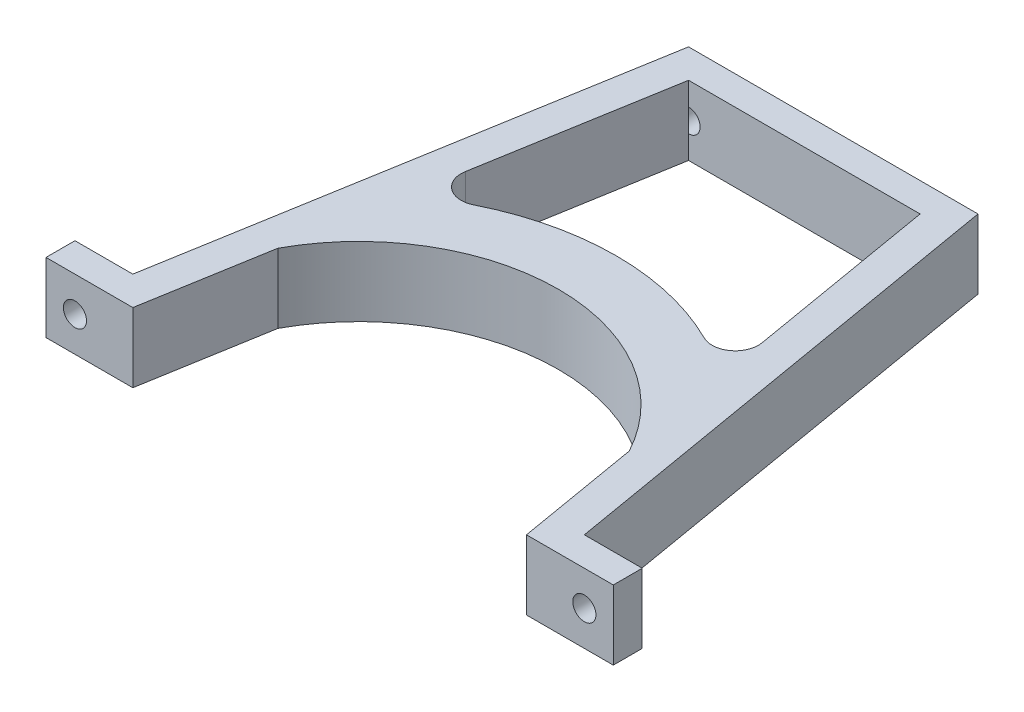
ISO-10303-21;
HEADER;
FILE_DESCRIPTION(('STEP AP214'),'2;1');
FILE_NAME('part.step','',(''),(''),'','','');
FILE_SCHEMA(('AUTOMOTIVE_DESIGN { 1 0 10303 214 1 1 1 1 }'));
ENDSEC;
DATA;
#1=APPLICATION_CONTEXT('core data for automotive mechanical design processes');
#2=APPLICATION_PROTOCOL_DEFINITION('international standard','automotive_design',2000,#1);
#3=PRODUCT_CONTEXT('',#1,'mechanical');
#4=PRODUCT('Part','Part','',(#3));
#5=PRODUCT_RELATED_PRODUCT_CATEGORY('part','',(#4));
#6=PRODUCT_DEFINITION_FORMATION('','',#4);
#7=PRODUCT_DEFINITION_CONTEXT('part definition',#1,'design');
#8=PRODUCT_DEFINITION('design','',#6,#7);
#9=PRODUCT_DEFINITION_SHAPE('','',#8);
#10=(LENGTH_UNIT() NAMED_UNIT(*) SI_UNIT(.MILLI.,.METRE.));
#11=(NAMED_UNIT(*) PLANE_ANGLE_UNIT() SI_UNIT($,.RADIAN.));
#12=(NAMED_UNIT(*) SI_UNIT($,.STERADIAN.) SOLID_ANGLE_UNIT());
#13=UNCERTAINTY_MEASURE_WITH_UNIT(LENGTH_MEASURE(1.E-05),#10,'distance_accuracy_value','');
#14=(GEOMETRIC_REPRESENTATION_CONTEXT(3) GLOBAL_UNCERTAINTY_ASSIGNED_CONTEXT((#13)) GLOBAL_UNIT_ASSIGNED_CONTEXT((#10,
#11,#12)) REPRESENTATION_CONTEXT('',''));
#15=CARTESIAN_POINT('',(0.,0.,0.));
#16=DIRECTION('',(0.,0.,1.));
#17=DIRECTION('',(1.,0.,0.));
#18=AXIS2_PLACEMENT_3D('',#15,#16,#17);
#19=CARTESIAN_POINT('',(0.,12.,-77.));
#20=DIRECTION('',(0.,0.,-1.));
#21=DIRECTION('',(-1.,0.,0.));
#22=AXIS2_PLACEMENT_3D('',#19,#20,#21);
#23=PLANE('',#22);
#24=DIRECTION('',(0.,-1.,0.));
#25=VECTOR('',#24,1.);
#26=CARTESIAN_POINT('',(-20.,12.,-77.));
#27=LINE('',#26,#25);
#28=CARTESIAN_POINT('',(-20.,12.,-77.));
#29=VERTEX_POINT('',#28);
#30=CARTESIAN_POINT('',(-20.,8.,-77.));
#31=VERTEX_POINT('',#30);
#32=EDGE_CURVE('E207',#29,#31,#27,.T.);
#33=ORIENTED_EDGE('',*,*,#32,.T.);
#34=CARTESIAN_POINT('',(-20.,6.,-77.));
#35=DIRECTION('',(0.,0.,1.));
#36=DIRECTION('',(1.,0.,0.));
#37=AXIS2_PLACEMENT_3D('',#34,#35,#36);
#38=CIRCLE('',#37,2.);
#39=CARTESIAN_POINT('',(-20.,4.,-77.));
#40=VERTEX_POINT('',#39);
#41=EDGE_CURVE('E199',#40,#31,#38,.T.);
#42=ORIENTED_EDGE('',*,*,#41,.F.);
#43=CARTESIAN_POINT('',(-20.,0.,-77.));
#44=VERTEX_POINT('',#43);
#45=EDGE_CURVE('E204',#40,#44,#27,.T.);
#46=ORIENTED_EDGE('',*,*,#45,.T.);
#47=DIRECTION('',(1.,0.,0.));
#48=VECTOR('',#47,1.);
#49=CARTESIAN_POINT('',(0.,0.,-77.));
#50=LINE('',#49,#48);
#51=CARTESIAN_POINT('',(20.,0.,-77.));
#52=VERTEX_POINT('',#51);
#53=EDGE_CURVE('E222',#44,#52,#50,.T.);
#54=ORIENTED_EDGE('',*,*,#53,.T.);
#55=DIRECTION('',(0.,-1.,0.));
#56=VECTOR('',#55,1.);
#57=CARTESIAN_POINT('',(20.,12.,-77.));
#58=LINE('',#57,#56);
#59=CARTESIAN_POINT('',(20.,4.,-77.));
#60=VERTEX_POINT('',#59);
#61=EDGE_CURVE('E189',#60,#52,#58,.T.);
#62=ORIENTED_EDGE('',*,*,#61,.F.);
#63=CARTESIAN_POINT('',(20.,6.,-77.));
#64=DIRECTION('',(0.,0.,1.));
#65=DIRECTION('',(1.,0.,0.));
#66=AXIS2_PLACEMENT_3D('',#63,#64,#65);
#67=CIRCLE('',#66,2.);
#68=CARTESIAN_POINT('',(20.,8.,-77.));
#69=VERTEX_POINT('',#68);
#70=EDGE_CURVE('E66',#60,#69,#67,.F.);
#71=ORIENTED_EDGE('',*,*,#70,.T.);
#72=CARTESIAN_POINT('',(20.,12.,-77.));
#73=VERTEX_POINT('',#72);
#74=EDGE_CURVE('E188',#73,#69,#58,.T.);
#75=ORIENTED_EDGE('',*,*,#74,.F.);
#76=DIRECTION('',(1.,0.,0.));
#77=VECTOR('',#76,1.);
#78=CARTESIAN_POINT('',(0.,12.,-77.));
#79=LINE('',#78,#77);
#80=EDGE_CURVE('E268',#29,#73,#79,.T.);
#81=ORIENTED_EDGE('',*,*,#80,.F.);
#82=EDGE_LOOP('',(#33,#42,#46,#54,#62,#71,#75,#81));
#83=FACE_BOUND('',#82,.T.);
#84=ADVANCED_FACE('F43',(#83),#23,.F.);
#85=CARTESIAN_POINT('',(0.,12.,-82.));
#86=DIRECTION('',(0.,0.,-1.));
#87=DIRECTION('',(-1.,0.,0.));
#88=AXIS2_PLACEMENT_3D('',#85,#86,#87);
#89=PLANE('',#88);
#90=CARTESIAN_POINT('',(20.,6.,-82.));
#91=DIRECTION('',(0.,0.,-1.));
#92=DIRECTION('',(-1.,0.,0.));
#93=AXIS2_PLACEMENT_3D('',#90,#91,#92);
#94=CIRCLE('',#93,2.);
#95=CARTESIAN_POINT('',(18.,6.,-82.));
#96=VERTEX_POINT('',#95);
#97=EDGE_CURVE('E314',#96,#96,#94,.F.);
#98=ORIENTED_EDGE('',*,*,#97,.T.);
#99=EDGE_LOOP('',(#98));
#100=FACE_BOUND('',#99,.T.);
#101=DIRECTION('',(1.,0.,0.));
#102=VECTOR('',#101,1.);
#103=CARTESIAN_POINT('',(0.,0.,-82.));
#104=LINE('',#103,#102);
#105=CARTESIAN_POINT('',(-25.,0.,-82.));
#106=VERTEX_POINT('',#105);
#107=CARTESIAN_POINT('',(25.,0.,-82.));
#108=VERTEX_POINT('',#107);
#109=EDGE_CURVE('E240',#106,#108,#104,.T.);
#110=ORIENTED_EDGE('',*,*,#109,.F.);
#111=DIRECTION('',(0.,-1.,0.));
#112=VECTOR('',#111,1.);
#113=CARTESIAN_POINT('',(-25.,12.,-82.));
#114=LINE('',#113,#112);
#115=CARTESIAN_POINT('',(-25.,12.,-82.));
#116=VERTEX_POINT('',#115);
#117=EDGE_CURVE('E339',#116,#106,#114,.T.);
#118=ORIENTED_EDGE('',*,*,#117,.F.);
#119=DIRECTION('',(1.,0.,0.));
#120=VECTOR('',#119,1.);
#121=CARTESIAN_POINT('',(0.,12.,-82.));
#122=LINE('',#121,#120);
#123=CARTESIAN_POINT('',(25.,12.,-82.));
#124=VERTEX_POINT('',#123);
#125=EDGE_CURVE('E284',#116,#124,#122,.T.);
#126=ORIENTED_EDGE('',*,*,#125,.T.);
#127=DIRECTION('',(0.,-1.,0.));
#128=VECTOR('',#127,1.);
#129=CARTESIAN_POINT('',(25.,12.,-82.));
#130=LINE('',#129,#128);
#131=EDGE_CURVE('E341',#124,#108,#130,.T.);
#132=ORIENTED_EDGE('',*,*,#131,.T.);
#133=EDGE_LOOP('',(#110,#118,#126,#132));
#134=FACE_BOUND('',#133,.T.);
#135=CARTESIAN_POINT('',(-20.,6.,-82.));
#136=DIRECTION('',(0.,0.,-1.));
#137=DIRECTION('',(-1.,0.,0.));
#138=AXIS2_PLACEMENT_3D('',#135,#136,#137);
#139=CIRCLE('',#138,2.);
#140=CARTESIAN_POINT('',(-22.,6.,-82.));
#141=VERTEX_POINT('',#140);
#142=EDGE_CURVE('E47',#141,#141,#139,.T.);
#143=ORIENTED_EDGE('',*,*,#142,.F.);
#144=EDGE_LOOP('',(#143));
#145=FACE_BOUND('',#144,.T.);
#146=ADVANCED_FACE('F405',(#100,#134,#145),#89,.T.);
#147=CARTESIAN_POINT('',(0.,12.,0.));
#148=DIRECTION('',(0.,-1.,0.));
#149=DIRECTION('',(0.,0.,-1.));
#150=AXIS2_PLACEMENT_3D('',#147,#148,#149);
#151=CYLINDRICAL_SURFACE('',#150,44.5);
#152=CARTESIAN_POINT('',(0.,0.,0.));
#153=DIRECTION('',(0.,1.,0.));
#154=DIRECTION('',(0.,0.,1.));
#155=AXIS2_PLACEMENT_3D('',#152,#153,#154);
#156=CIRCLE('',#155,44.5);
#157=CARTESIAN_POINT('',(19.8932896206944,0.,-39.8058667543765));
#158=VERTEX_POINT('',#157);
#159=CARTESIAN_POINT('',(-19.8932896206944,0.,-39.8058667543765));
#160=VERTEX_POINT('',#159);
#161=EDGE_CURVE('E228',#158,#160,#156,.T.);
#162=ORIENTED_EDGE('',*,*,#161,.T.);
#163=DIRECTION('',(0.,-1.,0.));
#164=VECTOR('',#163,1.);
#165=CARTESIAN_POINT('',(-19.8932896206944,12.,-39.8058667543765));
#166=LINE('',#165,#164);
#167=CARTESIAN_POINT('',(-19.8932896206944,12.,-39.8058667543765));
#168=VERTEX_POINT('',#167);
#169=EDGE_CURVE('E11',#168,#160,#166,.T.);
#170=ORIENTED_EDGE('',*,*,#169,.F.);
#171=CARTESIAN_POINT('',(0.,12.,0.));
#172=DIRECTION('',(0.,1.,0.));
#173=DIRECTION('',(0.,0.,1.));
#174=AXIS2_PLACEMENT_3D('',#171,#172,#173);
#175=CIRCLE('',#174,44.5);
#176=CARTESIAN_POINT('',(19.8932896206944,12.,-39.8058667543765));
#177=VERTEX_POINT('',#176);
#178=EDGE_CURVE('E273',#177,#168,#175,.T.);
#179=ORIENTED_EDGE('',*,*,#178,.F.);
#180=DIRECTION('',(0.,-1.,0.));
#181=VECTOR('',#180,1.);
#182=CARTESIAN_POINT('',(19.8932896206944,12.,-39.8058667543765));
#183=LINE('',#182,#181);
#184=EDGE_CURVE('E210',#177,#158,#183,.T.);
#185=ORIENTED_EDGE('',*,*,#184,.T.);
#186=EDGE_LOOP('',(#162,#170,#179,#185));
#187=FACE_BOUND('',#186,.T.);
#188=ADVANCED_FACE('F436',(#187),#151,.T.);
#189=CARTESIAN_POINT('',(-21.6814504854759,12.,-43.3839221929721));
#190=DIRECTION('',(0.,-1.,0.));
#191=DIRECTION('',(0.,0.,-1.));
#192=AXIS2_PLACEMENT_3D('',#189,#190,#191);
#193=CYLINDRICAL_SURFACE('',#192,4.);
#194=CARTESIAN_POINT('',(-21.6814504854759,0.,-43.3839221929721));
#195=DIRECTION('',(0.,1.,0.));
#196=DIRECTION('',(0.,0.,1.));
#197=AXIS2_PLACEMENT_3D('',#194,#195,#196);
#198=CIRCLE('',#197,4.);
#199=CARTESIAN_POINT('',(-25.6243961875175,0.,-44.0571080445402));
#200=VERTEX_POINT('',#199);
#201=EDGE_CURVE('E225',#160,#200,#198,.F.);
#202=ORIENTED_EDGE('',*,*,#201,.T.);
#203=DIRECTION('',(0.,-1.,0.));
#204=VECTOR('',#203,1.);
#205=CARTESIAN_POINT('',(-25.6243961875175,12.,-44.0571080445402));
#206=LINE('',#205,#204);
#207=CARTESIAN_POINT('',(-25.6243961875175,12.,-44.0571080445402));
#208=VERTEX_POINT('',#207);
#209=EDGE_CURVE('E52',#208,#200,#206,.T.);
#210=ORIENTED_EDGE('',*,*,#209,.F.);
#211=CARTESIAN_POINT('',(-21.6814504854759,12.,-43.3839221929721));
#212=DIRECTION('',(0.,1.,0.));
#213=DIRECTION('',(0.,0.,1.));
#214=AXIS2_PLACEMENT_3D('',#211,#212,#213);
#215=CIRCLE('',#214,4.);
#216=EDGE_CURVE('E271',#168,#208,#215,.F.);
#217=ORIENTED_EDGE('',*,*,#216,.F.);
#218=ORIENTED_EDGE('',*,*,#169,.T.);
#219=EDGE_LOOP('',(#202,#210,#217,#218));
#220=FACE_BOUND('',#219,.T.);
#221=ADVANCED_FACE('F443',(#220),#193,.F.);
#222=CARTESIAN_POINT('',(-32.2075144508671,12.,-5.49884393063584));
#223=DIRECTION('',(0.985736425510407,0.,0.168296462892021));
#224=DIRECTION('',(0.168296462892021,0.,-0.985736425510407));
#225=AXIS2_PLACEMENT_3D('',#222,#223,#224);
#226=PLANE('',#225);
#227=DIRECTION('',(-0.168296462892021,0.,0.985736425510407));
#228=VECTOR('',#227,1.);
#229=CARTESIAN_POINT('',(-32.2075144508671,0.,-5.49884393063584));
#230=LINE('',#229,#228);
#231=EDGE_CURVE('E224',#44,#200,#230,.T.);
#232=ORIENTED_EDGE('',*,*,#231,.F.);
#233=ORIENTED_EDGE('',*,*,#45,.F.);
#234=EDGE_CURVE('E205',#31,#40,#27,.T.);
#235=ORIENTED_EDGE('',*,*,#234,.F.);
#236=ORIENTED_EDGE('',*,*,#32,.F.);
#237=DIRECTION('',(-0.168296462892021,0.,0.985736425510407));
#238=VECTOR('',#237,1.);
#239=CARTESIAN_POINT('',(-32.2075144508671,12.,-5.49884393063584));
#240=LINE('',#239,#238);
#241=EDGE_CURVE('E270',#29,#208,#240,.T.);
#242=ORIENTED_EDGE('',*,*,#241,.T.);
#243=ORIENTED_EDGE('',*,*,#209,.T.);
#244=EDGE_LOOP('',(#232,#233,#235,#236,#242,#243));
#245=FACE_BOUND('',#244,.T.);
#246=ADVANCED_FACE('F324',(#245),#226,.T.);
#247=CARTESIAN_POINT('',(32.2075144508671,12.,-5.49884393063584));
#248=DIRECTION('',(0.985736425510407,0.,-0.168296462892021));
#249=DIRECTION('',(-0.168296462892021,0.,-0.985736425510407));
#250=AXIS2_PLACEMENT_3D('',#247,#248,#249);
#251=PLANE('',#250);
#252=DIRECTION('',(0.168296462892021,0.,0.985736425510407));
#253=VECTOR('',#252,1.);
#254=CARTESIAN_POINT('',(32.2075144508671,0.,-5.49884393063584));
#255=LINE('',#254,#253);
#256=CARTESIAN_POINT('',(25.6243961875175,0.,-44.0571080445402));
#257=VERTEX_POINT('',#256);
#258=EDGE_CURVE('E221',#52,#257,#255,.T.);
#259=ORIENTED_EDGE('',*,*,#258,.T.);
#260=DIRECTION('',(0.,-1.,0.));
#261=VECTOR('',#260,1.);
#262=CARTESIAN_POINT('',(25.6243961875175,12.,-44.0571080445402));
#263=LINE('',#262,#261);
#264=CARTESIAN_POINT('',(25.6243961875175,12.,-44.0571080445402));
#265=VERTEX_POINT('',#264);
#266=EDGE_CURVE('E209',#265,#257,#263,.T.);
#267=ORIENTED_EDGE('',*,*,#266,.F.);
#268=DIRECTION('',(0.168296462892021,0.,0.985736425510407));
#269=VECTOR('',#268,1.);
#270=CARTESIAN_POINT('',(32.2075144508671,12.,-5.49884393063584));
#271=LINE('',#270,#269);
#272=EDGE_CURVE('E203',#73,#265,#271,.T.);
#273=ORIENTED_EDGE('',*,*,#272,.F.);
#274=ORIENTED_EDGE('',*,*,#74,.T.);
#275=EDGE_CURVE('E182',#69,#60,#58,.T.);
#276=ORIENTED_EDGE('',*,*,#275,.T.);
#277=ORIENTED_EDGE('',*,*,#61,.T.);
#278=EDGE_LOOP('',(#259,#267,#273,#274,#276,#277));
#279=FACE_BOUND('',#278,.T.);
#280=ADVANCED_FACE('F201',(#279),#251,.F.);
#281=CARTESIAN_POINT('',(-30.3433796211126,0.,-16.4173479334833));
#282=VERTEX_POINT('',#281);
#283=CARTESIAN_POINT('',(-34.,0.,5.));
#284=VERTEX_POINT('',#283);
#285=EDGE_CURVE('E261',#282,#284,#230,.T.);
#286=ORIENTED_EDGE('',*,*,#285,.F.);
#287=DIRECTION('',(0.,-1.,0.));
#288=VECTOR('',#287,1.);
#289=CARTESIAN_POINT('',(-30.3433796211126,12.,-16.4173479334833));
#290=LINE('',#289,#288);
#291=CARTESIAN_POINT('',(-30.3433796211126,12.,-16.4173479334833));
#292=VERTEX_POINT('',#291);
#293=EDGE_CURVE('E214',#292,#282,#290,.T.);
#294=ORIENTED_EDGE('',*,*,#293,.F.);
#295=CARTESIAN_POINT('',(-34.,12.,5.));
#296=VERTEX_POINT('',#295);
#297=EDGE_CURVE('E220',#292,#296,#240,.T.);
#298=ORIENTED_EDGE('',*,*,#297,.T.);
#299=DIRECTION('',(0.,-1.,0.));
#300=VECTOR('',#299,1.);
#301=CARTESIAN_POINT('',(-34.,12.,5.));
#302=LINE('',#301,#300);
#303=EDGE_CURVE('E267',#296,#284,#302,.T.);
#304=ORIENTED_EDGE('',*,*,#303,.T.);
#305=EDGE_LOOP('',(#286,#294,#298,#304));
#306=FACE_BOUND('',#305,.T.);
#307=ADVANCED_FACE('F377',(#306),#226,.T.);
#308=CARTESIAN_POINT('',(0.,12.,0.));
#309=DIRECTION('',(0.,-1.,0.));
#310=DIRECTION('',(0.,0.,-1.));
#311=AXIS2_PLACEMENT_3D('',#308,#309,#310);
#312=CYLINDRICAL_SURFACE('',#311,34.5);
#313=CARTESIAN_POINT('',(0.,0.,0.));
#314=DIRECTION('',(0.,1.,0.));
#315=DIRECTION('',(0.,0.,1.));
#316=AXIS2_PLACEMENT_3D('',#313,#314,#315);
#317=CIRCLE('',#316,34.5);
#318=CARTESIAN_POINT('',(30.3433796211126,0.,-16.4173479334833));
#319=VERTEX_POINT('',#318);
#320=EDGE_CURVE('E258',#319,#282,#317,.T.);
#321=ORIENTED_EDGE('',*,*,#320,.F.);
#322=DIRECTION('',(0.,-1.,0.));
#323=VECTOR('',#322,1.);
#324=CARTESIAN_POINT('',(30.3433796211126,12.,-16.4173479334833));
#325=LINE('',#324,#323);
#326=CARTESIAN_POINT('',(30.3433796211126,12.,-16.4173479334833));
#327=VERTEX_POINT('',#326);
#328=EDGE_CURVE('E351',#327,#319,#325,.T.);
#329=ORIENTED_EDGE('',*,*,#328,.F.);
#330=CARTESIAN_POINT('',(0.,12.,0.));
#331=DIRECTION('',(0.,1.,0.));
#332=DIRECTION('',(0.,0.,1.));
#333=AXIS2_PLACEMENT_3D('',#330,#331,#332);
#334=CIRCLE('',#333,34.5);
#335=EDGE_CURVE('E300',#327,#292,#334,.T.);
#336=ORIENTED_EDGE('',*,*,#335,.T.);
#337=ORIENTED_EDGE('',*,*,#293,.T.);
#338=EDGE_LOOP('',(#321,#329,#336,#337));
#339=FACE_BOUND('',#338,.T.);
#340=ADVANCED_FACE('F45',(#339),#312,.F.);
#341=CARTESIAN_POINT('',(34.,0.,5.));
#342=VERTEX_POINT('',#341);
#343=EDGE_CURVE('E255',#319,#342,#255,.T.);
#344=ORIENTED_EDGE('',*,*,#343,.T.);
#345=DIRECTION('',(0.,-1.,0.));
#346=VECTOR('',#345,1.);
#347=CARTESIAN_POINT('',(34.,12.,5.));
#348=LINE('',#347,#346);
#349=CARTESIAN_POINT('',(34.,12.,5.));
#350=VERTEX_POINT('',#349);
#351=EDGE_CURVE('E349',#350,#342,#348,.T.);
#352=ORIENTED_EDGE('',*,*,#351,.F.);
#353=EDGE_CURVE('E298',#327,#350,#271,.T.);
#354=ORIENTED_EDGE('',*,*,#353,.F.);
#355=ORIENTED_EDGE('',*,*,#328,.T.);
#356=EDGE_LOOP('',(#344,#352,#354,#355));
#357=FACE_BOUND('',#356,.T.);
#358=ADVANCED_FACE('F387',(#357),#251,.F.);
#359=CARTESIAN_POINT('',(0.,12.,5.));
#360=DIRECTION('',(0.,0.,1.));
#361=DIRECTION('',(1.,0.,0.));
#362=AXIS2_PLACEMENT_3D('',#359,#360,#361);
#363=PLANE('',#362);
#364=CARTESIAN_POINT('',(44.,6.,5.));
#365=DIRECTION('',(0.,0.,1.));
#366=DIRECTION('',(1.,0.,0.));
#367=AXIS2_PLACEMENT_3D('',#364,#365,#366);
#368=CIRCLE('',#367,2.);
#369=CARTESIAN_POINT('',(46.,6.,5.));
#370=VERTEX_POINT('',#369);
#371=EDGE_CURVE('E264',#370,#370,#368,.T.);
#372=ORIENTED_EDGE('',*,*,#371,.F.);
#373=EDGE_LOOP('',(#372));
#374=FACE_BOUND('',#373,.T.);
#375=DIRECTION('',(-1.,0.,0.));
#376=VECTOR('',#375,1.);
#377=CARTESIAN_POINT('',(0.,0.,5.));
#378=LINE('',#377,#376);
#379=CARTESIAN_POINT('',(49.,0.,5.));
#380=VERTEX_POINT('',#379);
#381=EDGE_CURVE('E252',#380,#342,#378,.T.);
#382=ORIENTED_EDGE('',*,*,#381,.F.);
#383=DIRECTION('',(0.,-1.,0.));
#384=VECTOR('',#383,1.);
#385=CARTESIAN_POINT('',(49.,12.,5.));
#386=LINE('',#385,#384);
#387=CARTESIAN_POINT('',(49.,12.,5.));
#388=VERTEX_POINT('',#387);
#389=EDGE_CURVE('E347',#388,#380,#386,.T.);
#390=ORIENTED_EDGE('',*,*,#389,.F.);
#391=DIRECTION('',(-1.,0.,0.));
#392=VECTOR('',#391,1.);
#393=CARTESIAN_POINT('',(0.,12.,5.));
#394=LINE('',#393,#392);
#395=EDGE_CURVE('E295',#388,#350,#394,.T.);
#396=ORIENTED_EDGE('',*,*,#395,.T.);
#397=ORIENTED_EDGE('',*,*,#351,.T.);
#398=EDGE_LOOP('',(#382,#390,#396,#397));
#399=FACE_BOUND('',#398,.T.);
#400=ADVANCED_FACE('F543',(#374,#399),#363,.T.);
#401=CARTESIAN_POINT('',(49.,12.,0.));
#402=DIRECTION('',(1.,0.,0.));
#403=DIRECTION('',(0.,0.,-1.));
#404=AXIS2_PLACEMENT_3D('',#401,#402,#403);
#405=PLANE('',#404);
#406=DIRECTION('',(0.,0.,1.));
#407=VECTOR('',#406,1.);
#408=CARTESIAN_POINT('',(49.,0.,0.));
#409=LINE('',#408,#407);
#410=CARTESIAN_POINT('',(49.,0.,0.));
#411=VERTEX_POINT('',#410);
#412=EDGE_CURVE('E249',#411,#380,#409,.T.);
#413=ORIENTED_EDGE('',*,*,#412,.F.);
#414=DIRECTION('',(0.,-1.,0.));
#415=VECTOR('',#414,1.);
#416=CARTESIAN_POINT('',(49.,12.,0.));
#417=LINE('',#416,#415);
#418=CARTESIAN_POINT('',(49.,12.,0.));
#419=VERTEX_POINT('',#418);
#420=EDGE_CURVE('E345',#419,#411,#417,.T.);
#421=ORIENTED_EDGE('',*,*,#420,.F.);
#422=DIRECTION('',(0.,0.,1.));
#423=VECTOR('',#422,1.);
#424=CARTESIAN_POINT('',(49.,12.,0.));
#425=LINE('',#424,#423);
#426=EDGE_CURVE('E292',#419,#388,#425,.T.);
#427=ORIENTED_EDGE('',*,*,#426,.T.);
#428=ORIENTED_EDGE('',*,*,#389,.T.);
#429=EDGE_LOOP('',(#413,#421,#427,#428));
#430=FACE_BOUND('',#429,.T.);
#431=ADVANCED_FACE('F393',(#430),#405,.T.);
#432=CARTESIAN_POINT('',(0.,12.,0.));
#433=DIRECTION('',(0.,0.,1.));
#434=DIRECTION('',(1.,0.,0.));
#435=AXIS2_PLACEMENT_3D('',#432,#433,#434);
#436=PLANE('',#435);
#437=CARTESIAN_POINT('',(44.,6.,0.));
#438=DIRECTION('',(0.,0.,1.));
#439=DIRECTION('',(1.,0.,0.));
#440=AXIS2_PLACEMENT_3D('',#437,#438,#439);
#441=CIRCLE('',#440,2.);
#442=CARTESIAN_POINT('',(46.,6.,0.));
#443=VERTEX_POINT('',#442);
#444=EDGE_CURVE('E311',#443,#443,#441,.F.);
#445=ORIENTED_EDGE('',*,*,#444,.F.);
#446=EDGE_LOOP('',(#445));
#447=FACE_BOUND('',#446,.T.);
#448=DIRECTION('',(-1.,0.,0.));
#449=VECTOR('',#448,1.);
#450=CARTESIAN_POINT('',(0.,0.,0.));
#451=LINE('',#450,#449);
#452=CARTESIAN_POINT('',(39.,0.,0.));
#453=VERTEX_POINT('',#452);
#454=EDGE_CURVE('E246',#411,#453,#451,.T.);
#455=ORIENTED_EDGE('',*,*,#454,.T.);
#456=DIRECTION('',(0.,-1.,0.));
#457=VECTOR('',#456,1.);
#458=CARTESIAN_POINT('',(39.,12.,0.));
#459=LINE('',#458,#457);
#460=CARTESIAN_POINT('',(39.,12.,0.));
#461=VERTEX_POINT('',#460);
#462=EDGE_CURVE('E343',#461,#453,#459,.T.);
#463=ORIENTED_EDGE('',*,*,#462,.F.);
#464=DIRECTION('',(-1.,0.,0.));
#465=VECTOR('',#464,1.);
#466=CARTESIAN_POINT('',(0.,12.,0.));
#467=LINE('',#466,#465);
#468=EDGE_CURVE('E290',#419,#461,#467,.T.);
#469=ORIENTED_EDGE('',*,*,#468,.F.);
#470=ORIENTED_EDGE('',*,*,#420,.T.);
#471=EDGE_LOOP('',(#455,#463,#469,#470));
#472=FACE_BOUND('',#471,.T.);
#473=ADVANCED_FACE('F399',(#447,#472),#436,.F.);
#474=CARTESIAN_POINT('',(37.8953757225434,12.,-6.46994219653179));
#475=DIRECTION('',(0.985736425510407,0.,-0.168296462892021));
#476=DIRECTION('',(-0.168296462892021,0.,-0.985736425510407));
#477=AXIS2_PLACEMENT_3D('',#474,#475,#476);
#478=PLANE('',#477);
#479=DIRECTION('',(0.168296462892021,0.,0.985736425510407));
#480=VECTOR('',#479,1.);
#481=CARTESIAN_POINT('',(37.8953757225434,0.,-6.46994219653179));
#482=LINE('',#481,#480);
#483=EDGE_CURVE('E243',#108,#453,#482,.T.);
#484=ORIENTED_EDGE('',*,*,#483,.F.);
#485=ORIENTED_EDGE('',*,*,#131,.F.);
#486=DIRECTION('',(0.168296462892021,0.,0.985736425510407));
#487=VECTOR('',#486,1.);
#488=CARTESIAN_POINT('',(37.8953757225434,12.,-6.46994219653179));
#489=LINE('',#488,#487);
#490=EDGE_CURVE('E287',#124,#461,#489,.T.);
#491=ORIENTED_EDGE('',*,*,#490,.T.);
#492=ORIENTED_EDGE('',*,*,#462,.T.);
#493=EDGE_LOOP('',(#484,#485,#491,#492));
#494=FACE_BOUND('',#493,.T.);
#495=ADVANCED_FACE('F420',(#494),#478,.T.);
#496=CARTESIAN_POINT('',(-37.8953757225434,12.,-6.46994219653179));
#497=DIRECTION('',(0.985736425510407,0.,0.168296462892021));
#498=DIRECTION('',(0.168296462892021,0.,-0.985736425510407));
#499=AXIS2_PLACEMENT_3D('',#496,#497,#498);
#500=PLANE('',#499);
#501=DIRECTION('',(-0.168296462892021,0.,0.985736425510407));
#502=VECTOR('',#501,1.);
#503=CARTESIAN_POINT('',(-37.8953757225434,0.,-6.46994219653179));
#504=LINE('',#503,#502);
#505=CARTESIAN_POINT('',(-39.,0.,0.));
#506=VERTEX_POINT('',#505);
#507=EDGE_CURVE('E238',#106,#506,#504,.T.);
#508=ORIENTED_EDGE('',*,*,#507,.T.);
#509=DIRECTION('',(0.,-1.,0.));
#510=VECTOR('',#509,1.);
#511=CARTESIAN_POINT('',(-39.,12.,0.));
#512=LINE('',#511,#510);
#513=CARTESIAN_POINT('',(-39.,12.,0.));
#514=VERTEX_POINT('',#513);
#515=EDGE_CURVE('E336',#514,#506,#512,.T.);
#516=ORIENTED_EDGE('',*,*,#515,.F.);
#517=DIRECTION('',(-0.168296462892021,0.,0.985736425510407));
#518=VECTOR('',#517,1.);
#519=CARTESIAN_POINT('',(-37.8953757225434,12.,-6.46994219653179));
#520=LINE('',#519,#518);
#521=EDGE_CURVE('E282',#116,#514,#520,.T.);
#522=ORIENTED_EDGE('',*,*,#521,.F.);
#523=ORIENTED_EDGE('',*,*,#117,.T.);
#524=EDGE_LOOP('',(#508,#516,#522,#523));
#525=FACE_BOUND('',#524,.T.);
#526=ADVANCED_FACE('F412',(#525),#500,.F.);
#527=CARTESIAN_POINT('',(0.,12.,0.));
#528=DIRECTION('',(0.,0.,1.));
#529=DIRECTION('',(1.,0.,0.));
#530=AXIS2_PLACEMENT_3D('',#527,#528,#529);
#531=PLANE('',#530);
#532=CARTESIAN_POINT('',(-44.,6.,0.));
#533=DIRECTION('',(0.,0.,1.));
#534=DIRECTION('',(1.,0.,0.));
#535=AXIS2_PLACEMENT_3D('',#532,#533,#534);
#536=CIRCLE('',#535,2.);
#537=CARTESIAN_POINT('',(-42.,6.,0.));
#538=VERTEX_POINT('',#537);
#539=EDGE_CURVE('E308',#538,#538,#536,.T.);
#540=ORIENTED_EDGE('',*,*,#539,.T.);
#541=EDGE_LOOP('',(#540));
#542=FACE_BOUND('',#541,.T.);
#543=DIRECTION('',(-1.,0.,0.));
#544=VECTOR('',#543,1.);
#545=CARTESIAN_POINT('',(0.,0.,0.));
#546=LINE('',#545,#544);
#547=CARTESIAN_POINT('',(-49.,0.,0.));
#548=VERTEX_POINT('',#547);
#549=EDGE_CURVE('E236',#506,#548,#546,.T.);
#550=ORIENTED_EDGE('',*,*,#549,.T.);
#551=DIRECTION('',(0.,-1.,0.));
#552=VECTOR('',#551,1.);
#553=CARTESIAN_POINT('',(-49.,12.,0.));
#554=LINE('',#553,#552);
#555=CARTESIAN_POINT('',(-49.,12.,0.));
#556=VERTEX_POINT('',#555);
#557=EDGE_CURVE('E333',#556,#548,#554,.T.);
#558=ORIENTED_EDGE('',*,*,#557,.F.);
#559=DIRECTION('',(-1.,0.,0.));
#560=VECTOR('',#559,1.);
#561=CARTESIAN_POINT('',(0.,12.,0.));
#562=LINE('',#561,#560);
#563=EDGE_CURVE('E280',#514,#556,#562,.T.);
#564=ORIENTED_EDGE('',*,*,#563,.F.);
#565=ORIENTED_EDGE('',*,*,#515,.T.);
#566=EDGE_LOOP('',(#550,#558,#564,#565));
#567=FACE_BOUND('',#566,.T.);
#568=ADVANCED_FACE('F417',(#542,#567),#531,.F.);
#569=CARTESIAN_POINT('',(-49.,12.,0.));
#570=DIRECTION('',(1.,0.,0.));
#571=DIRECTION('',(0.,0.,-1.));
#572=AXIS2_PLACEMENT_3D('',#569,#570,#571);
#573=PLANE('',#572);
#574=DIRECTION('',(0.,0.,1.));
#575=VECTOR('',#574,1.);
#576=CARTESIAN_POINT('',(-49.,0.,0.));
#577=LINE('',#576,#575);
#578=CARTESIAN_POINT('',(-49.,0.,5.));
#579=VERTEX_POINT('',#578);
#580=EDGE_CURVE('E234',#548,#579,#577,.T.);
#581=ORIENTED_EDGE('',*,*,#580,.T.);
#582=DIRECTION('',(0.,-1.,0.));
#583=VECTOR('',#582,1.);
#584=CARTESIAN_POINT('',(-49.,12.,5.));
#585=LINE('',#584,#583);
#586=CARTESIAN_POINT('',(-49.,12.,5.));
#587=VERTEX_POINT('',#586);
#588=EDGE_CURVE('E330',#587,#579,#585,.T.);
#589=ORIENTED_EDGE('',*,*,#588,.F.);
#590=DIRECTION('',(0.,0.,1.));
#591=VECTOR('',#590,1.);
#592=CARTESIAN_POINT('',(-49.,12.,0.));
#593=LINE('',#592,#591);
#594=EDGE_CURVE('E278',#556,#587,#593,.T.);
#595=ORIENTED_EDGE('',*,*,#594,.F.);
#596=ORIENTED_EDGE('',*,*,#557,.T.);
#597=EDGE_LOOP('',(#581,#589,#595,#596));
#598=FACE_BOUND('',#597,.T.);
#599=ADVANCED_FACE('F363',(#598),#573,.F.);
#600=CARTESIAN_POINT('',(0.,12.,5.));
#601=DIRECTION('',(0.,0.,-1.));
#602=DIRECTION('',(-1.,0.,0.));
#603=AXIS2_PLACEMENT_3D('',#600,#601,#602);
#604=PLANE('',#603);
#605=CARTESIAN_POINT('',(-44.,6.,5.));
#606=DIRECTION('',(0.,0.,-1.));
#607=DIRECTION('',(-1.,0.,0.));
#608=AXIS2_PLACEMENT_3D('',#605,#606,#607);
#609=CIRCLE('',#608,2.);
#610=CARTESIAN_POINT('',(-46.,6.,5.));
#611=VERTEX_POINT('',#610);
#612=EDGE_CURVE('E307',#611,#611,#609,.F.);
#613=ORIENTED_EDGE('',*,*,#612,.F.);
#614=EDGE_LOOP('',(#613));
#615=FACE_BOUND('',#614,.T.);
#616=DIRECTION('',(1.,0.,0.));
#617=VECTOR('',#616,1.);
#618=CARTESIAN_POINT('',(0.,0.,5.));
#619=LINE('',#618,#617);
#620=EDGE_CURVE('E231',#579,#284,#619,.T.);
#621=ORIENTED_EDGE('',*,*,#620,.T.);
#622=ORIENTED_EDGE('',*,*,#303,.F.);
#623=DIRECTION('',(1.,0.,0.));
#624=VECTOR('',#623,1.);
#625=CARTESIAN_POINT('',(0.,12.,5.));
#626=LINE('',#625,#624);
#627=EDGE_CURVE('E276',#587,#296,#626,.T.);
#628=ORIENTED_EDGE('',*,*,#627,.F.);
#629=ORIENTED_EDGE('',*,*,#588,.T.);
#630=EDGE_LOOP('',(#621,#622,#628,#629));
#631=FACE_BOUND('',#630,.T.);
#632=ADVANCED_FACE('F359',(#615,#631),#604,.F.);
#633=CARTESIAN_POINT('',(21.6814504854759,12.,-43.3839221929721));
#634=DIRECTION('',(0.,-1.,0.));
#635=DIRECTION('',(0.,0.,-1.));
#636=AXIS2_PLACEMENT_3D('',#633,#634,#635);
#637=CYLINDRICAL_SURFACE('',#636,4.);
#638=CARTESIAN_POINT('',(21.6814504854759,0.,-43.3839221929721));
#639=DIRECTION('',(0.,1.,0.));
#640=DIRECTION('',(0.,0.,1.));
#641=AXIS2_PLACEMENT_3D('',#638,#639,#640);
#642=CIRCLE('',#641,4.);
#643=EDGE_CURVE('E217',#158,#257,#642,.T.);
#644=ORIENTED_EDGE('',*,*,#643,.F.);
#645=ORIENTED_EDGE('',*,*,#184,.F.);
#646=CARTESIAN_POINT('',(21.6814504854759,12.,-43.3839221929721));
#647=DIRECTION('',(0.,1.,0.));
#648=DIRECTION('',(0.,0.,1.));
#649=AXIS2_PLACEMENT_3D('',#646,#647,#648);
#650=CIRCLE('',#649,4.);
#651=EDGE_CURVE('E265',#177,#265,#650,.T.);
#652=ORIENTED_EDGE('',*,*,#651,.T.);
#653=ORIENTED_EDGE('',*,*,#266,.T.);
#654=EDGE_LOOP('',(#644,#645,#652,#653));
#655=FACE_BOUND('',#654,.T.);
#656=ADVANCED_FACE('F362',(#655),#637,.F.);
#657=CARTESIAN_POINT('',(0.,12.,0.));
#658=DIRECTION('',(0.,1.,0.));
#659=DIRECTION('',(0.,0.,1.));
#660=AXIS2_PLACEMENT_3D('',#657,#658,#659);
#661=PLANE('',#660);
#662=ORIENTED_EDGE('',*,*,#297,.F.);
#663=ORIENTED_EDGE('',*,*,#335,.F.);
#664=ORIENTED_EDGE('',*,*,#353,.T.);
#665=ORIENTED_EDGE('',*,*,#395,.F.);
#666=ORIENTED_EDGE('',*,*,#426,.F.);
#667=ORIENTED_EDGE('',*,*,#468,.T.);
#668=ORIENTED_EDGE('',*,*,#490,.F.);
#669=ORIENTED_EDGE('',*,*,#125,.F.);
#670=ORIENTED_EDGE('',*,*,#521,.T.);
#671=ORIENTED_EDGE('',*,*,#563,.T.);
#672=ORIENTED_EDGE('',*,*,#594,.T.);
#673=ORIENTED_EDGE('',*,*,#627,.T.);
#674=EDGE_LOOP('',(#662,#663,#664,#665,#666,#667,#668,#669,#670,#671,#672,#673));
#675=FACE_BOUND('',#674,.T.);
#676=ORIENTED_EDGE('',*,*,#178,.T.);
#677=ORIENTED_EDGE('',*,*,#216,.T.);
#678=ORIENTED_EDGE('',*,*,#241,.F.);
#679=ORIENTED_EDGE('',*,*,#80,.T.);
#680=ORIENTED_EDGE('',*,*,#272,.T.);
#681=ORIENTED_EDGE('',*,*,#651,.F.);
#682=EDGE_LOOP('',(#676,#677,#678,#679,#680,#681));
#683=FACE_BOUND('',#682,.T.);
#684=ADVANCED_FACE('F381',(#675,#683),#661,.T.);
#685=CARTESIAN_POINT('',(0.,0.,0.));
#686=DIRECTION('',(0.,1.,0.));
#687=DIRECTION('',(0.,0.,1.));
#688=AXIS2_PLACEMENT_3D('',#685,#686,#687);
#689=PLANE('',#688);
#690=ORIENTED_EDGE('',*,*,#285,.T.);
#691=ORIENTED_EDGE('',*,*,#620,.F.);
#692=ORIENTED_EDGE('',*,*,#580,.F.);
#693=ORIENTED_EDGE('',*,*,#549,.F.);
#694=ORIENTED_EDGE('',*,*,#507,.F.);
#695=ORIENTED_EDGE('',*,*,#109,.T.);
#696=ORIENTED_EDGE('',*,*,#483,.T.);
#697=ORIENTED_EDGE('',*,*,#454,.F.);
#698=ORIENTED_EDGE('',*,*,#412,.T.);
#699=ORIENTED_EDGE('',*,*,#381,.T.);
#700=ORIENTED_EDGE('',*,*,#343,.F.);
#701=ORIENTED_EDGE('',*,*,#320,.T.);
#702=EDGE_LOOP('',(#690,#691,#692,#693,#694,#695,#696,#697,#698,#699,#700,#701));
#703=FACE_BOUND('',#702,.T.);
#704=ORIENTED_EDGE('',*,*,#161,.F.);
#705=ORIENTED_EDGE('',*,*,#643,.T.);
#706=ORIENTED_EDGE('',*,*,#258,.F.);
#707=ORIENTED_EDGE('',*,*,#53,.F.);
#708=ORIENTED_EDGE('',*,*,#231,.T.);
#709=ORIENTED_EDGE('',*,*,#201,.F.);
#710=EDGE_LOOP('',(#704,#705,#706,#707,#708,#709));
#711=FACE_BOUND('',#710,.T.);
#712=ADVANCED_FACE('F372',(#703,#711),#689,.F.);
#713=CARTESIAN_POINT('',(-44.,6.,12.));
#714=DIRECTION('',(0.,0.,-1.));
#715=DIRECTION('',(-1.,0.,0.));
#716=AXIS2_PLACEMENT_3D('',#713,#714,#715);
#717=CYLINDRICAL_SURFACE('',#716,2.);
#718=ORIENTED_EDGE('',*,*,#539,.F.);
#719=EDGE_LOOP('',(#718));
#720=FACE_BOUND('',#719,.T.);
#721=ORIENTED_EDGE('',*,*,#612,.T.);
#722=EDGE_LOOP('',(#721));
#723=FACE_BOUND('',#722,.T.);
#724=ADVANCED_FACE('F357',(#720,#723),#717,.F.);
#725=CARTESIAN_POINT('',(44.,6.,12.));
#726=DIRECTION('',(0.,0.,-1.));
#727=DIRECTION('',(-1.,0.,0.));
#728=AXIS2_PLACEMENT_3D('',#725,#726,#727);
#729=CYLINDRICAL_SURFACE('',#728,2.);
#730=ORIENTED_EDGE('',*,*,#371,.T.);
#731=EDGE_LOOP('',(#730));
#732=FACE_BOUND('',#731,.T.);
#733=ORIENTED_EDGE('',*,*,#444,.T.);
#734=EDGE_LOOP('',(#733));
#735=FACE_BOUND('',#734,.T.);
#736=ADVANCED_FACE('F459',(#732,#735),#729,.F.);
#737=CARTESIAN_POINT('',(0.,0.,-77.));
#738=DIRECTION('',(0.,0.,1.));
#739=DIRECTION('',(1.,0.,0.));
#740=AXIS2_PLACEMENT_3D('',#737,#738,#739);
#741=PLANE('',#740);
#742=EDGE_CURVE('E184',#69,#60,#67,.F.);
#743=ORIENTED_EDGE('',*,*,#742,.T.);
#744=ORIENTED_EDGE('',*,*,#275,.F.);
#745=EDGE_LOOP('',(#743,#744));
#746=FACE_BOUND('',#745,.T.);
#747=ADVANCED_FACE('F183',(#746),#741,.F.);
#748=CARTESIAN_POINT('',(20.,6.,-89.));
#749=DIRECTION('',(0.,0.,1.));
#750=DIRECTION('',(1.,0.,0.));
#751=AXIS2_PLACEMENT_3D('',#748,#749,#750);
#752=CYLINDRICAL_SURFACE('',#751,2.);
#753=ORIENTED_EDGE('',*,*,#97,.F.);
#754=EDGE_LOOP('',(#753));
#755=FACE_BOUND('',#754,.T.);
#756=ORIENTED_EDGE('',*,*,#70,.F.);
#757=ORIENTED_EDGE('',*,*,#742,.F.);
#758=EDGE_LOOP('',(#756,#757));
#759=FACE_BOUND('',#758,.T.);
#760=ADVANCED_FACE('F191',(#755,#759),#752,.F.);
#761=CARTESIAN_POINT('',(-20.,6.,-89.));
#762=DIRECTION('',(0.,0.,1.));
#763=DIRECTION('',(1.,0.,0.));
#764=AXIS2_PLACEMENT_3D('',#761,#762,#763);
#765=CYLINDRICAL_SURFACE('',#764,2.);
#766=ORIENTED_EDGE('',*,*,#142,.T.);
#767=EDGE_LOOP('',(#766));
#768=FACE_BOUND('',#767,.T.);
#769=EDGE_CURVE('E59',#31,#40,#38,.T.);
#770=ORIENTED_EDGE('',*,*,#769,.T.);
#771=ORIENTED_EDGE('',*,*,#41,.T.);
#772=EDGE_LOOP('',(#770,#771));
#773=FACE_BOUND('',#772,.T.);
#774=ADVANCED_FACE('F317',(#768,#773),#765,.F.);
#775=CARTESIAN_POINT('',(0.,0.,-77.));
#776=DIRECTION('',(0.,0.,1.));
#777=DIRECTION('',(1.,0.,0.));
#778=AXIS2_PLACEMENT_3D('',#775,#776,#777);
#779=PLANE('',#778);
#780=ORIENTED_EDGE('',*,*,#234,.T.);
#781=ORIENTED_EDGE('',*,*,#769,.F.);
#782=EDGE_LOOP('',(#780,#781));
#783=FACE_BOUND('',#782,.T.);
#784=ADVANCED_FACE('F321',(#783),#779,.F.);
#785=CLOSED_SHELL('',(#84,#146,#188,#221,#246,#280,#307,#340,#358,#400,#431,#473,#495,#526,#568,
#599,#632,#656,#684,#712,#724,#736,#747,#760,#774,#784));
#786=MANIFOLD_SOLID_BREP('B2',#785);
#787=ADVANCED_BREP_SHAPE_REPRESENTATION('',(#18,#786),#14);
#788=SHAPE_DEFINITION_REPRESENTATION(#9,#787);
ENDSEC;
END-ISO-10303-21;
